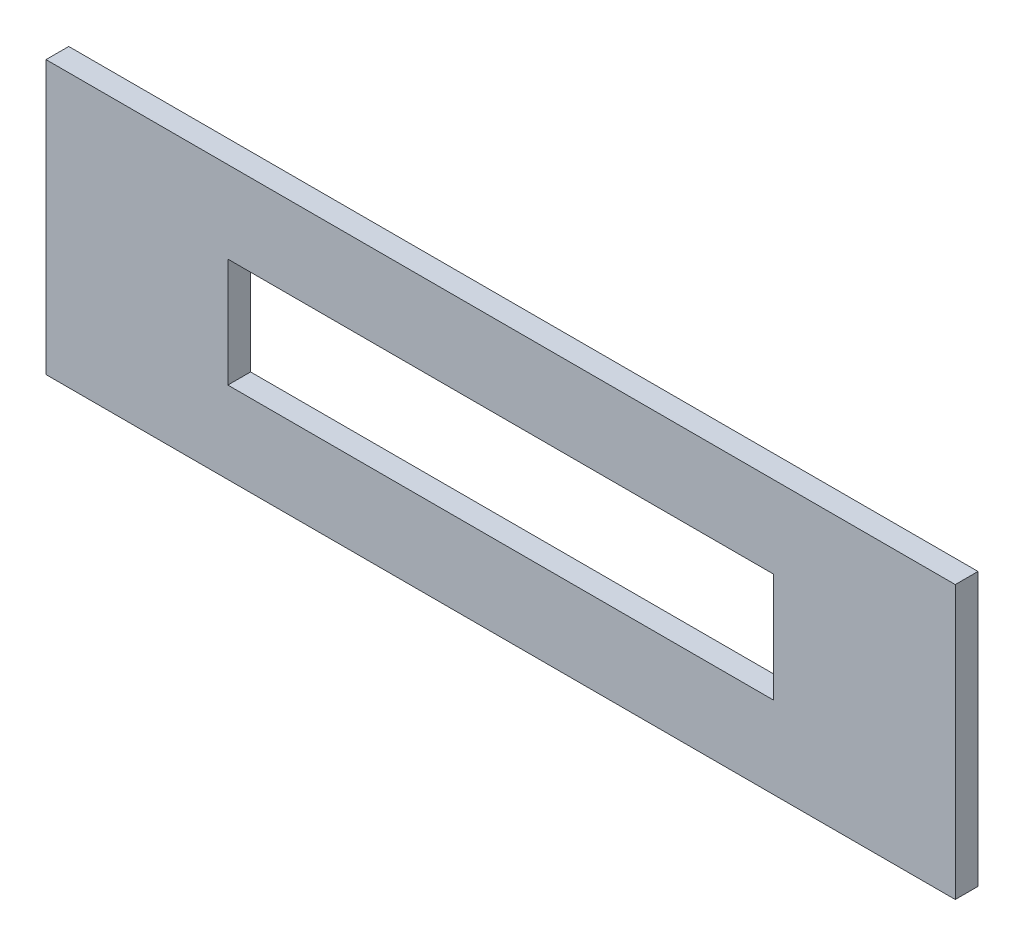
ISO-10303-21;
HEADER;
FILE_DESCRIPTION(('STEP AP214'),'2;1');
FILE_NAME('part.step','',(''),(''),'','','');
FILE_SCHEMA(('AUTOMOTIVE_DESIGN { 1 0 10303 214 1 1 1 1 }'));
ENDSEC;
DATA;
#1=APPLICATION_CONTEXT('core data for automotive mechanical design processes');
#2=APPLICATION_PROTOCOL_DEFINITION('international standard','automotive_design',2000,#1);
#3=PRODUCT_CONTEXT('',#1,'mechanical');
#4=PRODUCT('Part','Part','',(#3));
#5=PRODUCT_RELATED_PRODUCT_CATEGORY('part','',(#4));
#6=PRODUCT_DEFINITION_FORMATION('','',#4);
#7=PRODUCT_DEFINITION_CONTEXT('part definition',#1,'design');
#8=PRODUCT_DEFINITION('design','',#6,#7);
#9=PRODUCT_DEFINITION_SHAPE('','',#8);
#10=(LENGTH_UNIT() NAMED_UNIT(*) SI_UNIT(.MILLI.,.METRE.));
#11=(NAMED_UNIT(*) PLANE_ANGLE_UNIT() SI_UNIT($,.RADIAN.));
#12=(NAMED_UNIT(*) SI_UNIT($,.STERADIAN.) SOLID_ANGLE_UNIT());
#13=UNCERTAINTY_MEASURE_WITH_UNIT(LENGTH_MEASURE(1.E-05),#10,'distance_accuracy_value','');
#14=(GEOMETRIC_REPRESENTATION_CONTEXT(3) GLOBAL_UNCERTAINTY_ASSIGNED_CONTEXT((#13)) GLOBAL_UNIT_ASSIGNED_CONTEXT((#10,
#11,#12)) REPRESENTATION_CONTEXT('',''));
#15=CARTESIAN_POINT('',(0.,0.,0.));
#16=DIRECTION('',(0.,0.,1.));
#17=DIRECTION('',(1.,0.,0.));
#18=AXIS2_PLACEMENT_3D('',#15,#16,#17);
#19=CARTESIAN_POINT('',(0.,0.,10.));
#20=DIRECTION('',(0.,0.,1.));
#21=DIRECTION('',(1.,0.,0.));
#22=AXIS2_PLACEMENT_3D('',#19,#20,#21);
#23=PLANE('',#22);
#24=DIRECTION('',(0.,1.,0.));
#25=VECTOR('',#24,1.);
#26=CARTESIAN_POINT('',(200.,60.,10.));
#27=LINE('',#26,#25);
#28=CARTESIAN_POINT('',(200.,-60.,10.));
#29=VERTEX_POINT('',#28);
#30=CARTESIAN_POINT('',(200.,60.,10.));
#31=VERTEX_POINT('',#30);
#32=EDGE_CURVE('E135',#29,#31,#27,.T.);
#33=ORIENTED_EDGE('',*,*,#32,.T.);
#34=DIRECTION('',(-1.,0.,0.));
#35=VECTOR('',#34,1.);
#36=CARTESIAN_POINT('',(-200.,60.,10.));
#37=LINE('',#36,#35);
#38=CARTESIAN_POINT('',(-200.,60.,10.));
#39=VERTEX_POINT('',#38);
#40=EDGE_CURVE('E138',#31,#39,#37,.T.);
#41=ORIENTED_EDGE('',*,*,#40,.T.);
#42=DIRECTION('',(0.,-1.,0.));
#43=VECTOR('',#42,1.);
#44=CARTESIAN_POINT('',(-200.,60.,10.));
#45=LINE('',#44,#43);
#46=CARTESIAN_POINT('',(-200.,-60.,10.));
#47=VERTEX_POINT('',#46);
#48=EDGE_CURVE('E141',#39,#47,#45,.T.);
#49=ORIENTED_EDGE('',*,*,#48,.T.);
#50=DIRECTION('',(1.,0.,0.));
#51=VECTOR('',#50,1.);
#52=CARTESIAN_POINT('',(-200.,-60.,10.));
#53=LINE('',#52,#51);
#54=EDGE_CURVE('E143',#47,#29,#53,.T.);
#55=ORIENTED_EDGE('',*,*,#54,.T.);
#56=EDGE_LOOP('',(#33,#41,#49,#55));
#57=FACE_BOUND('',#56,.T.);
#58=DIRECTION('',(-1.,0.,0.));
#59=VECTOR('',#58,1.);
#60=CARTESIAN_POINT('',(-120.,24.,10.));
#61=LINE('',#60,#59);
#62=CARTESIAN_POINT('',(120.,24.,10.));
#63=VERTEX_POINT('',#62);
#64=CARTESIAN_POINT('',(-120.,24.,10.));
#65=VERTEX_POINT('',#64);
#66=EDGE_CURVE('E107',#63,#65,#61,.T.);
#67=ORIENTED_EDGE('',*,*,#66,.F.);
#68=DIRECTION('',(0.,1.,0.));
#69=VECTOR('',#68,1.);
#70=CARTESIAN_POINT('',(120.,24.,10.));
#71=LINE('',#70,#69);
#72=CARTESIAN_POINT('',(120.,-24.,10.));
#73=VERTEX_POINT('',#72);
#74=EDGE_CURVE('E99',#73,#63,#71,.T.);
#75=ORIENTED_EDGE('',*,*,#74,.F.);
#76=DIRECTION('',(1.,0.,0.));
#77=VECTOR('',#76,1.);
#78=CARTESIAN_POINT('',(-120.,-24.,10.));
#79=LINE('',#78,#77);
#80=CARTESIAN_POINT('',(-120.,-24.,10.));
#81=VERTEX_POINT('',#80);
#82=EDGE_CURVE('E121',#81,#73,#79,.T.);
#83=ORIENTED_EDGE('',*,*,#82,.F.);
#84=DIRECTION('',(0.,-1.,0.));
#85=VECTOR('',#84,1.);
#86=CARTESIAN_POINT('',(-120.,24.,10.));
#87=LINE('',#86,#85);
#88=EDGE_CURVE('E119',#65,#81,#87,.T.);
#89=ORIENTED_EDGE('',*,*,#88,.F.);
#90=EDGE_LOOP('',(#67,#75,#83,#89));
#91=FACE_BOUND('',#90,.T.);
#92=ADVANCED_FACE('F34',(#57,#91),#23,.T.);
#93=CARTESIAN_POINT('',(0.,0.,0.));
#94=DIRECTION('',(0.,0.,1.));
#95=DIRECTION('',(1.,0.,0.));
#96=AXIS2_PLACEMENT_3D('',#93,#94,#95);
#97=PLANE('',#96);
#98=DIRECTION('',(0.,1.,0.));
#99=VECTOR('',#98,1.);
#100=CARTESIAN_POINT('',(200.,60.,0.));
#101=LINE('',#100,#99);
#102=CARTESIAN_POINT('',(200.,-60.,0.));
#103=VERTEX_POINT('',#102);
#104=CARTESIAN_POINT('',(200.,60.,0.));
#105=VERTEX_POINT('',#104);
#106=EDGE_CURVE('E115',#103,#105,#101,.T.);
#107=ORIENTED_EDGE('',*,*,#106,.F.);
#108=DIRECTION('',(1.,0.,0.));
#109=VECTOR('',#108,1.);
#110=CARTESIAN_POINT('',(-200.,-60.,0.));
#111=LINE('',#110,#109);
#112=CARTESIAN_POINT('',(-200.,-60.,0.));
#113=VERTEX_POINT('',#112);
#114=EDGE_CURVE('E139',#113,#103,#111,.T.);
#115=ORIENTED_EDGE('',*,*,#114,.F.);
#116=DIRECTION('',(0.,-1.,0.));
#117=VECTOR('',#116,1.);
#118=CARTESIAN_POINT('',(-200.,60.,0.));
#119=LINE('',#118,#117);
#120=CARTESIAN_POINT('',(-200.,60.,0.));
#121=VERTEX_POINT('',#120);
#122=EDGE_CURVE('E150',#121,#113,#119,.T.);
#123=ORIENTED_EDGE('',*,*,#122,.F.);
#124=DIRECTION('',(-1.,0.,0.));
#125=VECTOR('',#124,1.);
#126=CARTESIAN_POINT('',(-200.,60.,0.));
#127=LINE('',#126,#125);
#128=EDGE_CURVE('E148',#105,#121,#127,.T.);
#129=ORIENTED_EDGE('',*,*,#128,.F.);
#130=EDGE_LOOP('',(#107,#115,#123,#129));
#131=FACE_BOUND('',#130,.T.);
#132=DIRECTION('',(0.,1.,0.));
#133=VECTOR('',#132,1.);
#134=CARTESIAN_POINT('',(120.,24.,0.));
#135=LINE('',#134,#133);
#136=CARTESIAN_POINT('',(120.,-24.,0.));
#137=VERTEX_POINT('',#136);
#138=CARTESIAN_POINT('',(120.,24.,0.));
#139=VERTEX_POINT('',#138);
#140=EDGE_CURVE('E57',#137,#139,#135,.T.);
#141=ORIENTED_EDGE('',*,*,#140,.T.);
#142=DIRECTION('',(-1.,0.,0.));
#143=VECTOR('',#142,1.);
#144=CARTESIAN_POINT('',(-120.,24.,0.));
#145=LINE('',#144,#143);
#146=CARTESIAN_POINT('',(-120.,24.,0.));
#147=VERTEX_POINT('',#146);
#148=EDGE_CURVE('E114',#139,#147,#145,.T.);
#149=ORIENTED_EDGE('',*,*,#148,.T.);
#150=DIRECTION('',(0.,-1.,0.));
#151=VECTOR('',#150,1.);
#152=CARTESIAN_POINT('',(-120.,24.,0.));
#153=LINE('',#152,#151);
#154=CARTESIAN_POINT('',(-120.,-24.,0.));
#155=VERTEX_POINT('',#154);
#156=EDGE_CURVE('E127',#147,#155,#153,.T.);
#157=ORIENTED_EDGE('',*,*,#156,.T.);
#158=DIRECTION('',(1.,0.,0.));
#159=VECTOR('',#158,1.);
#160=CARTESIAN_POINT('',(-120.,-24.,0.));
#161=LINE('',#160,#159);
#162=EDGE_CURVE('E108',#155,#137,#161,.T.);
#163=ORIENTED_EDGE('',*,*,#162,.T.);
#164=EDGE_LOOP('',(#141,#149,#157,#163));
#165=FACE_BOUND('',#164,.T.);
#166=ADVANCED_FACE('F168',(#131,#165),#97,.F.);
#167=CARTESIAN_POINT('',(200.,60.,10.));
#168=DIRECTION('',(-1.,0.,0.));
#169=DIRECTION('',(0.,0.,1.));
#170=AXIS2_PLACEMENT_3D('',#167,#168,#169);
#171=PLANE('',#170);
#172=ORIENTED_EDGE('',*,*,#106,.T.);
#173=DIRECTION('',(0.,0.,-1.));
#174=VECTOR('',#173,1.);
#175=CARTESIAN_POINT('',(200.,60.,10.));
#176=LINE('',#175,#174);
#177=EDGE_CURVE('E11',#31,#105,#176,.T.);
#178=ORIENTED_EDGE('',*,*,#177,.F.);
#179=ORIENTED_EDGE('',*,*,#32,.F.);
#180=DIRECTION('',(0.,0.,-1.));
#181=VECTOR('',#180,1.);
#182=CARTESIAN_POINT('',(200.,-60.,10.));
#183=LINE('',#182,#181);
#184=EDGE_CURVE('E145',#29,#103,#183,.T.);
#185=ORIENTED_EDGE('',*,*,#184,.T.);
#186=EDGE_LOOP('',(#172,#178,#179,#185));
#187=FACE_BOUND('',#186,.T.);
#188=ADVANCED_FACE('F36',(#187),#171,.F.);
#189=CARTESIAN_POINT('',(-200.,60.,10.));
#190=DIRECTION('',(0.,-1.,0.));
#191=DIRECTION('',(0.,0.,-1.));
#192=AXIS2_PLACEMENT_3D('',#189,#190,#191);
#193=PLANE('',#192);
#194=ORIENTED_EDGE('',*,*,#128,.T.);
#195=DIRECTION('',(0.,0.,-1.));
#196=VECTOR('',#195,1.);
#197=CARTESIAN_POINT('',(-200.,60.,10.));
#198=LINE('',#197,#196);
#199=EDGE_CURVE('E42',#39,#121,#198,.T.);
#200=ORIENTED_EDGE('',*,*,#199,.F.);
#201=ORIENTED_EDGE('',*,*,#40,.F.);
#202=ORIENTED_EDGE('',*,*,#177,.T.);
#203=EDGE_LOOP('',(#194,#200,#201,#202));
#204=FACE_BOUND('',#203,.T.);
#205=ADVANCED_FACE('F178',(#204),#193,.F.);
#206=CARTESIAN_POINT('',(-200.,60.,10.));
#207=DIRECTION('',(1.,0.,0.));
#208=DIRECTION('',(0.,0.,-1.));
#209=AXIS2_PLACEMENT_3D('',#206,#207,#208);
#210=PLANE('',#209);
#211=ORIENTED_EDGE('',*,*,#122,.T.);
#212=DIRECTION('',(0.,0.,-1.));
#213=VECTOR('',#212,1.);
#214=CARTESIAN_POINT('',(-200.,-60.,10.));
#215=LINE('',#214,#213);
#216=EDGE_CURVE('E155',#47,#113,#215,.T.);
#217=ORIENTED_EDGE('',*,*,#216,.F.);
#218=ORIENTED_EDGE('',*,*,#48,.F.);
#219=ORIENTED_EDGE('',*,*,#199,.T.);
#220=EDGE_LOOP('',(#211,#217,#218,#219));
#221=FACE_BOUND('',#220,.T.);
#222=ADVANCED_FACE('F162',(#221),#210,.F.);
#223=CARTESIAN_POINT('',(-200.,-60.,10.));
#224=DIRECTION('',(0.,1.,0.));
#225=DIRECTION('',(0.,0.,1.));
#226=AXIS2_PLACEMENT_3D('',#223,#224,#225);
#227=PLANE('',#226);
#228=ORIENTED_EDGE('',*,*,#114,.T.);
#229=ORIENTED_EDGE('',*,*,#184,.F.);
#230=ORIENTED_EDGE('',*,*,#54,.F.);
#231=ORIENTED_EDGE('',*,*,#216,.T.);
#232=EDGE_LOOP('',(#228,#229,#230,#231));
#233=FACE_BOUND('',#232,.T.);
#234=ADVANCED_FACE('F172',(#233),#227,.F.);
#235=CARTESIAN_POINT('',(120.,24.,10.));
#236=DIRECTION('',(-1.,0.,0.));
#237=DIRECTION('',(0.,-1.,0.));
#238=AXIS2_PLACEMENT_3D('',#235,#236,#237);
#239=PLANE('',#238);
#240=ORIENTED_EDGE('',*,*,#140,.F.);
#241=DIRECTION('',(0.,0.,-1.));
#242=VECTOR('',#241,1.);
#243=CARTESIAN_POINT('',(120.,-24.,10.));
#244=LINE('',#243,#242);
#245=EDGE_CURVE('E103',#73,#137,#244,.T.);
#246=ORIENTED_EDGE('',*,*,#245,.F.);
#247=ORIENTED_EDGE('',*,*,#74,.T.);
#248=DIRECTION('',(0.,0.,-1.));
#249=VECTOR('',#248,1.);
#250=CARTESIAN_POINT('',(120.,24.,10.));
#251=LINE('',#250,#249);
#252=EDGE_CURVE('E102',#63,#139,#251,.T.);
#253=ORIENTED_EDGE('',*,*,#252,.T.);
#254=EDGE_LOOP('',(#240,#246,#247,#253));
#255=FACE_BOUND('',#254,.T.);
#256=ADVANCED_FACE('F101',(#255),#239,.T.);
#257=CARTESIAN_POINT('',(-120.,24.,10.));
#258=DIRECTION('',(0.,-1.,0.));
#259=DIRECTION('',(0.,0.,-1.));
#260=AXIS2_PLACEMENT_3D('',#257,#258,#259);
#261=PLANE('',#260);
#262=ORIENTED_EDGE('',*,*,#148,.F.);
#263=ORIENTED_EDGE('',*,*,#252,.F.);
#264=ORIENTED_EDGE('',*,*,#66,.T.);
#265=DIRECTION('',(0.,0.,-1.));
#266=VECTOR('',#265,1.);
#267=CARTESIAN_POINT('',(-120.,24.,10.));
#268=LINE('',#267,#266);
#269=EDGE_CURVE('E116',#65,#147,#268,.T.);
#270=ORIENTED_EDGE('',*,*,#269,.T.);
#271=EDGE_LOOP('',(#262,#263,#264,#270));
#272=FACE_BOUND('',#271,.T.);
#273=ADVANCED_FACE('F111',(#272),#261,.T.);
#274=CARTESIAN_POINT('',(-120.,24.,10.));
#275=DIRECTION('',(1.,0.,0.));
#276=DIRECTION('',(0.,0.,-1.));
#277=AXIS2_PLACEMENT_3D('',#274,#275,#276);
#278=PLANE('',#277);
#279=ORIENTED_EDGE('',*,*,#156,.F.);
#280=ORIENTED_EDGE('',*,*,#269,.F.);
#281=ORIENTED_EDGE('',*,*,#88,.T.);
#282=DIRECTION('',(0.,0.,-1.));
#283=VECTOR('',#282,1.);
#284=CARTESIAN_POINT('',(-120.,-24.,10.));
#285=LINE('',#284,#283);
#286=EDGE_CURVE('E49',#81,#155,#285,.T.);
#287=ORIENTED_EDGE('',*,*,#286,.T.);
#288=EDGE_LOOP('',(#279,#280,#281,#287));
#289=FACE_BOUND('',#288,.T.);
#290=ADVANCED_FACE('F201',(#289),#278,.T.);
#291=CARTESIAN_POINT('',(-120.,-24.,10.));
#292=DIRECTION('',(0.,1.,0.));
#293=DIRECTION('',(0.,0.,1.));
#294=AXIS2_PLACEMENT_3D('',#291,#292,#293);
#295=PLANE('',#294);
#296=ORIENTED_EDGE('',*,*,#162,.F.);
#297=ORIENTED_EDGE('',*,*,#286,.F.);
#298=ORIENTED_EDGE('',*,*,#82,.T.);
#299=ORIENTED_EDGE('',*,*,#245,.T.);
#300=EDGE_LOOP('',(#296,#297,#298,#299));
#301=FACE_BOUND('',#300,.T.);
#302=ADVANCED_FACE('F205',(#301),#295,.T.);
#303=CLOSED_SHELL('',(#92,#166,#188,#205,#222,#234,#256,#273,#290,#302));
#304=MANIFOLD_SOLID_BREP('B2',#303);
#305=ADVANCED_BREP_SHAPE_REPRESENTATION('',(#18,#304),#14);
#306=SHAPE_DEFINITION_REPRESENTATION(#9,#305);
ENDSEC;
END-ISO-10303-21;
